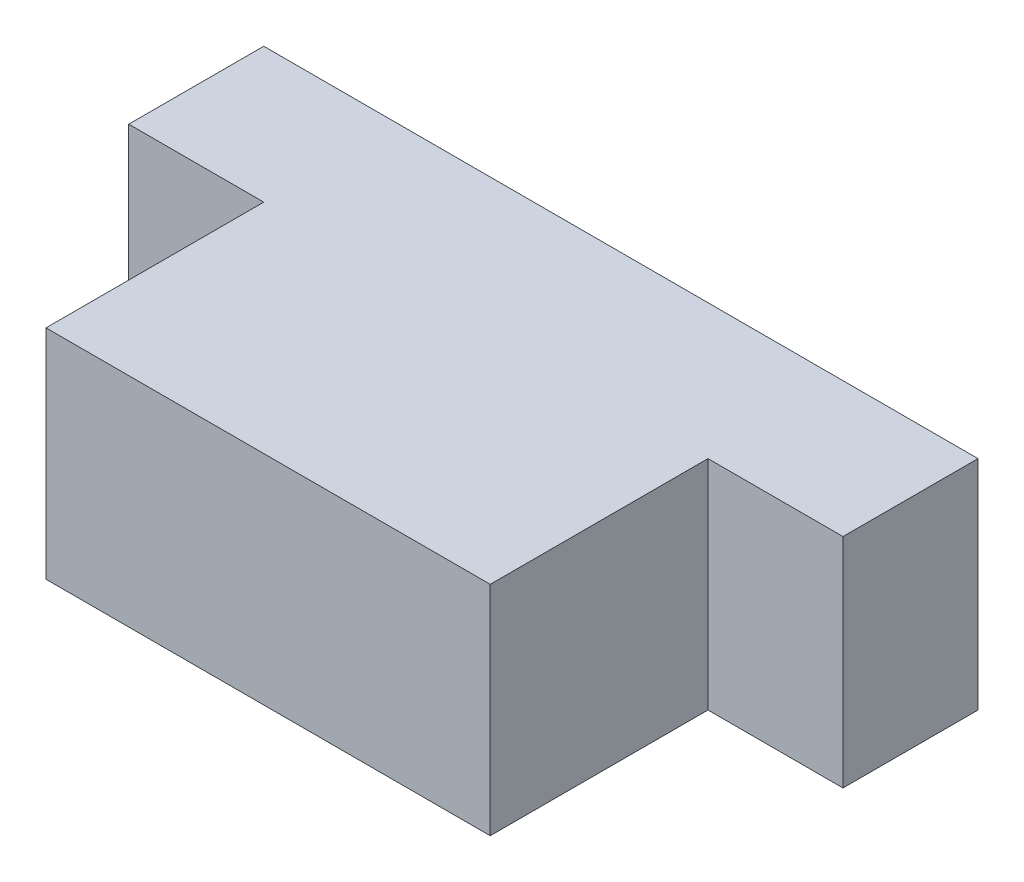
ISO-10303-21;
HEADER;
FILE_DESCRIPTION(('STEP AP214'),'2;1');
FILE_NAME('part.step','',(''),(''),'','','');
FILE_SCHEMA(('AUTOMOTIVE_DESIGN { 1 0 10303 214 1 1 1 1 }'));
ENDSEC;
DATA;
#1=APPLICATION_CONTEXT('core data for automotive mechanical design processes');
#2=APPLICATION_PROTOCOL_DEFINITION('international standard','automotive_design',2000,#1);
#3=PRODUCT_CONTEXT('',#1,'mechanical');
#4=PRODUCT('Part','Part','',(#3));
#5=PRODUCT_RELATED_PRODUCT_CATEGORY('part','',(#4));
#6=PRODUCT_DEFINITION_FORMATION('','',#4);
#7=PRODUCT_DEFINITION_CONTEXT('part definition',#1,'design');
#8=PRODUCT_DEFINITION('design','',#6,#7);
#9=PRODUCT_DEFINITION_SHAPE('','',#8);
#10=(LENGTH_UNIT() NAMED_UNIT(*) SI_UNIT(.MILLI.,.METRE.));
#11=(NAMED_UNIT(*) PLANE_ANGLE_UNIT() SI_UNIT($,.RADIAN.));
#12=(NAMED_UNIT(*) SI_UNIT($,.STERADIAN.) SOLID_ANGLE_UNIT());
#13=UNCERTAINTY_MEASURE_WITH_UNIT(LENGTH_MEASURE(1.E-05),#10,'distance_accuracy_value','');
#14=(GEOMETRIC_REPRESENTATION_CONTEXT(3) GLOBAL_UNCERTAINTY_ASSIGNED_CONTEXT((#13)) GLOBAL_UNIT_ASSIGNED_CONTEXT((#10,
#11,#12)) REPRESENTATION_CONTEXT('',''));
#15=CARTESIAN_POINT('',(0.,0.,0.));
#16=DIRECTION('',(0.,0.,1.));
#17=DIRECTION('',(1.,0.,0.));
#18=AXIS2_PLACEMENT_3D('',#15,#16,#17);
#19=CARTESIAN_POINT('',(-3.1,5.,-5.));
#20=DIRECTION('',(0.,0.,-1.));
#21=DIRECTION('',(-1.,0.,0.));
#22=AXIS2_PLACEMENT_3D('',#19,#20,#21);
#23=PLANE('',#22);
#24=DIRECTION('',(1.,0.,0.));
#25=VECTOR('',#24,1.);
#26=CARTESIAN_POINT('',(-3.1,0.,-5.));
#27=LINE('',#26,#25);
#28=CARTESIAN_POINT('',(-3.1,0.,-5.));
#29=VERTEX_POINT('',#28);
#30=CARTESIAN_POINT('',(0.,0.,-5.));
#31=VERTEX_POINT('',#30);
#32=EDGE_CURVE('E131',#29,#31,#27,.T.);
#33=ORIENTED_EDGE('',*,*,#32,.T.);
#34=DIRECTION('',(0.,-1.,0.));
#35=VECTOR('',#34,1.);
#36=CARTESIAN_POINT('',(0.,5.,-5.));
#37=LINE('',#36,#35);
#38=CARTESIAN_POINT('',(0.,5.,-5.));
#39=VERTEX_POINT('',#38);
#40=EDGE_CURVE('E11',#39,#31,#37,.T.);
#41=ORIENTED_EDGE('',*,*,#40,.F.);
#42=DIRECTION('',(1.,0.,0.));
#43=VECTOR('',#42,1.);
#44=CARTESIAN_POINT('',(-3.1,5.,-5.));
#45=LINE('',#44,#43);
#46=CARTESIAN_POINT('',(-3.1,5.,-5.));
#47=VERTEX_POINT('',#46);
#48=EDGE_CURVE('E145',#47,#39,#45,.T.);
#49=ORIENTED_EDGE('',*,*,#48,.F.);
#50=DIRECTION('',(0.,-1.,0.));
#51=VECTOR('',#50,1.);
#52=CARTESIAN_POINT('',(-3.1,5.,-5.));
#53=LINE('',#52,#51);
#54=EDGE_CURVE('E127',#47,#29,#53,.T.);
#55=ORIENTED_EDGE('',*,*,#54,.T.);
#56=EDGE_LOOP('',(#33,#41,#49,#55));
#57=FACE_BOUND('',#56,.T.);
#58=ADVANCED_FACE('F35',(#57),#23,.F.);
#59=CARTESIAN_POINT('',(0.,5.,-5.));
#60=DIRECTION('',(1.,0.,0.));
#61=DIRECTION('',(0.,0.,-1.));
#62=AXIS2_PLACEMENT_3D('',#59,#60,#61);
#63=PLANE('',#62);
#64=DIRECTION('',(0.,0.,1.));
#65=VECTOR('',#64,1.);
#66=CARTESIAN_POINT('',(0.,0.,-5.));
#67=LINE('',#66,#65);
#68=CARTESIAN_POINT('',(0.,0.,0.));
#69=VERTEX_POINT('',#68);
#70=EDGE_CURVE('E134',#31,#69,#67,.T.);
#71=ORIENTED_EDGE('',*,*,#70,.T.);
#72=DIRECTION('',(0.,-1.,0.));
#73=VECTOR('',#72,1.);
#74=CARTESIAN_POINT('',(0.,5.,0.));
#75=LINE('',#74,#73);
#76=CARTESIAN_POINT('',(0.,5.,0.));
#77=VERTEX_POINT('',#76);
#78=EDGE_CURVE('E43',#77,#69,#75,.T.);
#79=ORIENTED_EDGE('',*,*,#78,.F.);
#80=DIRECTION('',(0.,0.,1.));
#81=VECTOR('',#80,1.);
#82=CARTESIAN_POINT('',(0.,5.,-5.));
#83=LINE('',#82,#81);
#84=EDGE_CURVE('E94',#39,#77,#83,.T.);
#85=ORIENTED_EDGE('',*,*,#84,.F.);
#86=ORIENTED_EDGE('',*,*,#40,.T.);
#87=EDGE_LOOP('',(#71,#79,#85,#86));
#88=FACE_BOUND('',#87,.T.);
#89=ADVANCED_FACE('F180',(#88),#63,.F.);
#90=CARTESIAN_POINT('',(0.,5.,0.));
#91=DIRECTION('',(0.,0.,-1.));
#92=DIRECTION('',(-1.,0.,0.));
#93=AXIS2_PLACEMENT_3D('',#90,#91,#92);
#94=PLANE('',#93);
#95=DIRECTION('',(1.,0.,0.));
#96=VECTOR('',#95,1.);
#97=CARTESIAN_POINT('',(0.,0.,0.));
#98=LINE('',#97,#96);
#99=CARTESIAN_POINT('',(10.2,0.,0.));
#100=VERTEX_POINT('',#99);
#101=EDGE_CURVE('E136',#69,#100,#98,.T.);
#102=ORIENTED_EDGE('',*,*,#101,.T.);
#103=DIRECTION('',(0.,-1.,0.));
#104=VECTOR('',#103,1.);
#105=CARTESIAN_POINT('',(10.2,5.,0.));
#106=LINE('',#105,#104);
#107=CARTESIAN_POINT('',(10.2,5.,0.));
#108=VERTEX_POINT('',#107);
#109=EDGE_CURVE('E152',#108,#100,#106,.T.);
#110=ORIENTED_EDGE('',*,*,#109,.F.);
#111=DIRECTION('',(1.,0.,0.));
#112=VECTOR('',#111,1.);
#113=CARTESIAN_POINT('',(0.,5.,0.));
#114=LINE('',#113,#112);
#115=EDGE_CURVE('E160',#77,#108,#114,.T.);
#116=ORIENTED_EDGE('',*,*,#115,.F.);
#117=ORIENTED_EDGE('',*,*,#78,.T.);
#118=EDGE_LOOP('',(#102,#110,#116,#117));
#119=FACE_BOUND('',#118,.T.);
#120=ADVANCED_FACE('F158',(#119),#94,.F.);
#121=CARTESIAN_POINT('',(10.2,5.,0.));
#122=DIRECTION('',(-1.,0.,0.));
#123=DIRECTION('',(0.,0.,1.));
#124=AXIS2_PLACEMENT_3D('',#121,#122,#123);
#125=PLANE('',#124);
#126=DIRECTION('',(0.,0.,-1.));
#127=VECTOR('',#126,1.);
#128=CARTESIAN_POINT('',(10.2,0.,0.));
#129=LINE('',#128,#127);
#130=CARTESIAN_POINT('',(10.2,0.,-5.));
#131=VERTEX_POINT('',#130);
#132=EDGE_CURVE('E138',#100,#131,#129,.T.);
#133=ORIENTED_EDGE('',*,*,#132,.T.);
#134=DIRECTION('',(0.,-1.,0.));
#135=VECTOR('',#134,1.);
#136=CARTESIAN_POINT('',(10.2,5.,-5.));
#137=LINE('',#136,#135);
#138=CARTESIAN_POINT('',(10.2,5.,-5.));
#139=VERTEX_POINT('',#138);
#140=EDGE_CURVE('E149',#139,#131,#137,.T.);
#141=ORIENTED_EDGE('',*,*,#140,.F.);
#142=DIRECTION('',(0.,0.,-1.));
#143=VECTOR('',#142,1.);
#144=CARTESIAN_POINT('',(10.2,5.,0.));
#145=LINE('',#144,#143);
#146=EDGE_CURVE('E172',#108,#139,#145,.T.);
#147=ORIENTED_EDGE('',*,*,#146,.F.);
#148=ORIENTED_EDGE('',*,*,#109,.T.);
#149=EDGE_LOOP('',(#133,#141,#147,#148));
#150=FACE_BOUND('',#149,.T.);
#151=ADVANCED_FACE('F168',(#150),#125,.F.);
#152=CARTESIAN_POINT('',(10.2,5.,-5.));
#153=DIRECTION('',(0.,0.,-1.));
#154=DIRECTION('',(-1.,0.,0.));
#155=AXIS2_PLACEMENT_3D('',#152,#153,#154);
#156=PLANE('',#155);
#157=DIRECTION('',(1.,0.,0.));
#158=VECTOR('',#157,1.);
#159=CARTESIAN_POINT('',(10.2,0.,-5.));
#160=LINE('',#159,#158);
#161=CARTESIAN_POINT('',(13.3,0.,-5.));
#162=VERTEX_POINT('',#161);
#163=EDGE_CURVE('E140',#131,#162,#160,.T.);
#164=ORIENTED_EDGE('',*,*,#163,.T.);
#165=DIRECTION('',(0.,-1.,0.));
#166=VECTOR('',#165,1.);
#167=CARTESIAN_POINT('',(13.3,5.,-5.));
#168=LINE('',#167,#166);
#169=CARTESIAN_POINT('',(13.3,5.,-5.));
#170=VERTEX_POINT('',#169);
#171=EDGE_CURVE('E122',#170,#162,#168,.T.);
#172=ORIENTED_EDGE('',*,*,#171,.F.);
#173=DIRECTION('',(1.,0.,0.));
#174=VECTOR('',#173,1.);
#175=CARTESIAN_POINT('',(10.2,5.,-5.));
#176=LINE('',#175,#174);
#177=EDGE_CURVE('E113',#139,#170,#176,.T.);
#178=ORIENTED_EDGE('',*,*,#177,.F.);
#179=ORIENTED_EDGE('',*,*,#140,.T.);
#180=EDGE_LOOP('',(#164,#172,#178,#179));
#181=FACE_BOUND('',#180,.T.);
#182=ADVANCED_FACE('F171',(#181),#156,.F.);
#183=CARTESIAN_POINT('',(13.3,5.,-5.));
#184=DIRECTION('',(-1.,0.,0.));
#185=DIRECTION('',(0.,0.,1.));
#186=AXIS2_PLACEMENT_3D('',#183,#184,#185);
#187=PLANE('',#186);
#188=DIRECTION('',(0.,0.,-1.));
#189=VECTOR('',#188,1.);
#190=CARTESIAN_POINT('',(13.3,0.,-5.));
#191=LINE('',#190,#189);
#192=CARTESIAN_POINT('',(13.3,0.,-8.1));
#193=VERTEX_POINT('',#192);
#194=EDGE_CURVE('E121',#162,#193,#191,.T.);
#195=ORIENTED_EDGE('',*,*,#194,.T.);
#196=DIRECTION('',(0.,-1.,0.));
#197=VECTOR('',#196,1.);
#198=CARTESIAN_POINT('',(13.3,5.,-8.1));
#199=LINE('',#198,#197);
#200=CARTESIAN_POINT('',(13.3,5.,-8.1));
#201=VERTEX_POINT('',#200);
#202=EDGE_CURVE('E118',#201,#193,#199,.T.);
#203=ORIENTED_EDGE('',*,*,#202,.F.);
#204=DIRECTION('',(0.,0.,-1.));
#205=VECTOR('',#204,1.);
#206=CARTESIAN_POINT('',(13.3,5.,-5.));
#207=LINE('',#206,#205);
#208=EDGE_CURVE('E107',#170,#201,#207,.T.);
#209=ORIENTED_EDGE('',*,*,#208,.F.);
#210=ORIENTED_EDGE('',*,*,#171,.T.);
#211=EDGE_LOOP('',(#195,#203,#209,#210));
#212=FACE_BOUND('',#211,.T.);
#213=ADVANCED_FACE('F119',(#212),#187,.F.);
#214=CARTESIAN_POINT('',(13.3,5.,-8.1));
#215=DIRECTION('',(0.,0.,1.));
#216=DIRECTION('',(1.,0.,0.));
#217=AXIS2_PLACEMENT_3D('',#214,#215,#216);
#218=PLANE('',#217);
#219=DIRECTION('',(-1.,0.,0.));
#220=VECTOR('',#219,1.);
#221=CARTESIAN_POINT('',(13.3,0.,-8.1));
#222=LINE('',#221,#220);
#223=CARTESIAN_POINT('',(-3.1,0.,-8.1));
#224=VERTEX_POINT('',#223);
#225=EDGE_CURVE('E80',#193,#224,#222,.T.);
#226=ORIENTED_EDGE('',*,*,#225,.T.);
#227=DIRECTION('',(0.,-1.,0.));
#228=VECTOR('',#227,1.);
#229=CARTESIAN_POINT('',(-3.1,5.,-8.1));
#230=LINE('',#229,#228);
#231=CARTESIAN_POINT('',(-3.1,5.,-8.1));
#232=VERTEX_POINT('',#231);
#233=EDGE_CURVE('E123',#232,#224,#230,.T.);
#234=ORIENTED_EDGE('',*,*,#233,.F.);
#235=DIRECTION('',(-1.,0.,0.));
#236=VECTOR('',#235,1.);
#237=CARTESIAN_POINT('',(13.3,5.,-8.1));
#238=LINE('',#237,#236);
#239=EDGE_CURVE('E111',#201,#232,#238,.T.);
#240=ORIENTED_EDGE('',*,*,#239,.F.);
#241=ORIENTED_EDGE('',*,*,#202,.T.);
#242=EDGE_LOOP('',(#226,#234,#240,#241));
#243=FACE_BOUND('',#242,.T.);
#244=ADVANCED_FACE('F125',(#243),#218,.F.);
#245=CARTESIAN_POINT('',(-3.1,5.,-8.1));
#246=DIRECTION('',(1.,0.,0.));
#247=DIRECTION('',(0.,0.,-1.));
#248=AXIS2_PLACEMENT_3D('',#245,#246,#247);
#249=PLANE('',#248);
#250=DIRECTION('',(0.,0.,1.));
#251=VECTOR('',#250,1.);
#252=CARTESIAN_POINT('',(-3.1,0.,-8.1));
#253=LINE('',#252,#251);
#254=EDGE_CURVE('E86',#224,#29,#253,.T.);
#255=ORIENTED_EDGE('',*,*,#254,.T.);
#256=ORIENTED_EDGE('',*,*,#54,.F.);
#257=DIRECTION('',(0.,0.,1.));
#258=VECTOR('',#257,1.);
#259=CARTESIAN_POINT('',(-3.1,5.,-8.1));
#260=LINE('',#259,#258);
#261=EDGE_CURVE('E51',#232,#47,#260,.T.);
#262=ORIENTED_EDGE('',*,*,#261,.F.);
#263=ORIENTED_EDGE('',*,*,#233,.T.);
#264=EDGE_LOOP('',(#255,#256,#262,#263));
#265=FACE_BOUND('',#264,.T.);
#266=ADVANCED_FACE('F196',(#265),#249,.F.);
#267=CARTESIAN_POINT('',(0.,5.,0.));
#268=DIRECTION('',(0.,-1.,0.));
#269=DIRECTION('',(0.,0.,-1.));
#270=AXIS2_PLACEMENT_3D('',#267,#268,#269);
#271=PLANE('',#270);
#272=ORIENTED_EDGE('',*,*,#48,.T.);
#273=ORIENTED_EDGE('',*,*,#84,.T.);
#274=ORIENTED_EDGE('',*,*,#115,.T.);
#275=ORIENTED_EDGE('',*,*,#146,.T.);
#276=ORIENTED_EDGE('',*,*,#177,.T.);
#277=ORIENTED_EDGE('',*,*,#208,.T.);
#278=ORIENTED_EDGE('',*,*,#239,.T.);
#279=ORIENTED_EDGE('',*,*,#261,.T.);
#280=EDGE_LOOP('',(#272,#273,#274,#275,#276,#277,#278,#279));
#281=FACE_BOUND('',#280,.T.);
#282=ADVANCED_FACE('F109',(#281),#271,.F.);
#283=CARTESIAN_POINT('',(0.,0.,0.));
#284=DIRECTION('',(0.,-1.,0.));
#285=DIRECTION('',(0.,0.,-1.));
#286=AXIS2_PLACEMENT_3D('',#283,#284,#285);
#287=PLANE('',#286);
#288=ORIENTED_EDGE('',*,*,#32,.F.);
#289=ORIENTED_EDGE('',*,*,#254,.F.);
#290=ORIENTED_EDGE('',*,*,#225,.F.);
#291=ORIENTED_EDGE('',*,*,#194,.F.);
#292=ORIENTED_EDGE('',*,*,#163,.F.);
#293=ORIENTED_EDGE('',*,*,#132,.F.);
#294=ORIENTED_EDGE('',*,*,#101,.F.);
#295=ORIENTED_EDGE('',*,*,#70,.F.);
#296=EDGE_LOOP('',(#288,#289,#290,#291,#292,#293,#294,#295));
#297=FACE_BOUND('',#296,.T.);
#298=ADVANCED_FACE('F164',(#297),#287,.T.);
#299=CLOSED_SHELL('',(#58,#89,#120,#151,#182,#213,#244,#266,#282,#298));
#300=MANIFOLD_SOLID_BREP('B2',#299);
#301=ADVANCED_BREP_SHAPE_REPRESENTATION('',(#18,#300),#14);
#302=SHAPE_DEFINITION_REPRESENTATION(#9,#301);
ENDSEC;
END-ISO-10303-21;
